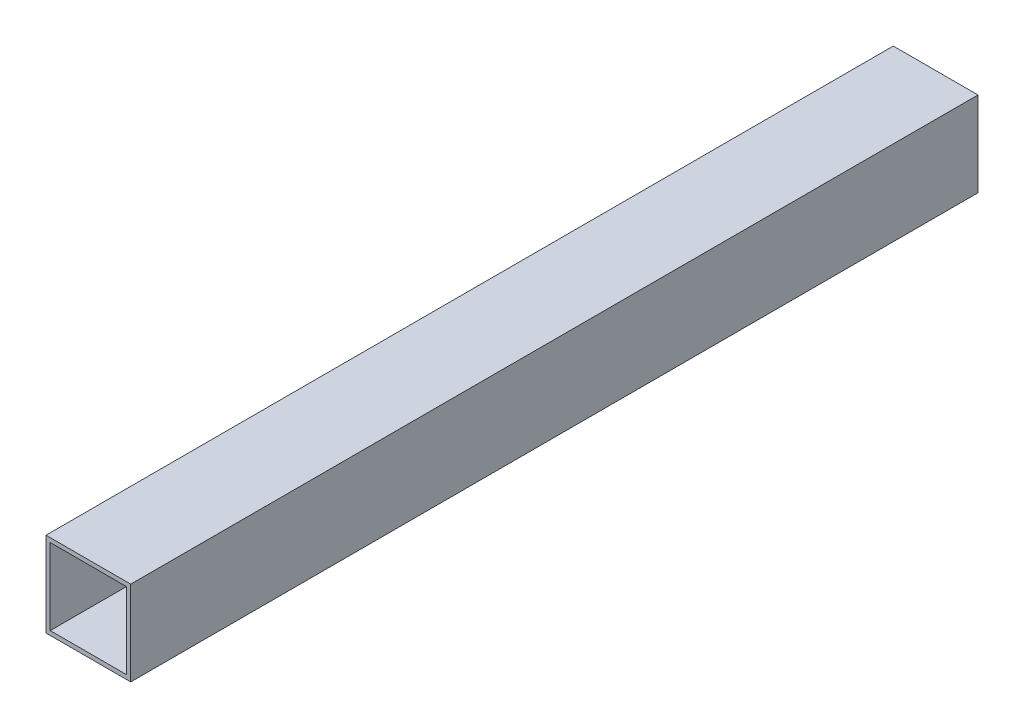
ISO-10303-21;
HEADER;
FILE_DESCRIPTION(('STEP AP214'),'2;1');
FILE_NAME('part.step','',(''),(''),'','','');
FILE_SCHEMA(('AUTOMOTIVE_DESIGN { 1 0 10303 214 1 1 1 1 }'));
ENDSEC;
DATA;
#1=APPLICATION_CONTEXT('core data for automotive mechanical design processes');
#2=APPLICATION_PROTOCOL_DEFINITION('international standard','automotive_design',2000,#1);
#3=PRODUCT_CONTEXT('',#1,'mechanical');
#4=PRODUCT('Part','Part','',(#3));
#5=PRODUCT_RELATED_PRODUCT_CATEGORY('part','',(#4));
#6=PRODUCT_DEFINITION_FORMATION('','',#4);
#7=PRODUCT_DEFINITION_CONTEXT('part definition',#1,'design');
#8=PRODUCT_DEFINITION('design','',#6,#7);
#9=PRODUCT_DEFINITION_SHAPE('','',#8);
#10=(LENGTH_UNIT() NAMED_UNIT(*) SI_UNIT(.MILLI.,.METRE.));
#11=(NAMED_UNIT(*) PLANE_ANGLE_UNIT() SI_UNIT($,.RADIAN.));
#12=(NAMED_UNIT(*) SI_UNIT($,.STERADIAN.) SOLID_ANGLE_UNIT());
#13=UNCERTAINTY_MEASURE_WITH_UNIT(LENGTH_MEASURE(1.E-05),#10,'distance_accuracy_value','');
#14=(GEOMETRIC_REPRESENTATION_CONTEXT(3) GLOBAL_UNCERTAINTY_ASSIGNED_CONTEXT((#13)) GLOBAL_UNIT_ASSIGNED_CONTEXT((#10,
#11,#12)) REPRESENTATION_CONTEXT('',''));
#15=CARTESIAN_POINT('',(0.,0.,0.));
#16=DIRECTION('',(0.,0.,1.));
#17=DIRECTION('',(1.,0.,0.));
#18=AXIS2_PLACEMENT_3D('',#15,#16,#17);
#19=CARTESIAN_POINT('',(0.,0.,500.));
#20=DIRECTION('',(0.,0.,-1.));
#21=DIRECTION('',(-1.,0.,0.));
#22=AXIS2_PLACEMENT_3D('',#19,#20,#21);
#23=PLANE('',#22);
#24=DIRECTION('',(0.,-1.,0.));
#25=VECTOR('',#24,1.);
#26=CARTESIAN_POINT('',(-50.,-50.,500.));
#27=LINE('',#26,#25);
#28=CARTESIAN_POINT('',(-50.,49.9999999999999,500.));
#29=VERTEX_POINT('',#28);
#30=CARTESIAN_POINT('',(-50.,-50.,500.));
#31=VERTEX_POINT('',#30);
#32=EDGE_CURVE('E162',#29,#31,#27,.T.);
#33=ORIENTED_EDGE('',*,*,#32,.T.);
#34=DIRECTION('',(1.,0.,0.));
#35=VECTOR('',#34,1.);
#36=CARTESIAN_POINT('',(-50.,-50.,500.));
#37=LINE('',#36,#35);
#38=CARTESIAN_POINT('',(50.,-50.,500.));
#39=VERTEX_POINT('',#38);
#40=EDGE_CURVE('E165',#31,#39,#37,.T.);
#41=ORIENTED_EDGE('',*,*,#40,.T.);
#42=DIRECTION('',(0.,1.,0.));
#43=VECTOR('',#42,1.);
#44=CARTESIAN_POINT('',(50.,-50.,500.));
#45=LINE('',#44,#43);
#46=CARTESIAN_POINT('',(49.9999999999999,49.9999999999999,500.));
#47=VERTEX_POINT('',#46);
#48=EDGE_CURVE('E168',#39,#47,#45,.T.);
#49=ORIENTED_EDGE('',*,*,#48,.T.);
#50=DIRECTION('',(-1.,0.,0.));
#51=VECTOR('',#50,1.);
#52=CARTESIAN_POINT('',(-50.,49.9999999999999,500.));
#53=LINE('',#52,#51);
#54=EDGE_CURVE('E170',#47,#29,#53,.T.);
#55=ORIENTED_EDGE('',*,*,#54,.T.);
#56=EDGE_LOOP('',(#33,#41,#49,#55));
#57=FACE_BOUND('',#56,.T.);
#58=DIRECTION('',(0.,-1.,0.));
#59=VECTOR('',#58,1.);
#60=CARTESIAN_POINT('',(-45.,-45.,500.));
#61=LINE('',#60,#59);
#62=CARTESIAN_POINT('',(-45.,44.9999999999999,500.));
#63=VERTEX_POINT('',#62);
#64=CARTESIAN_POINT('',(-45.,-45.,500.));
#65=VERTEX_POINT('',#64);
#66=EDGE_CURVE('E116',#63,#65,#61,.T.);
#67=ORIENTED_EDGE('',*,*,#66,.F.);
#68=DIRECTION('',(-1.,0.,0.));
#69=VECTOR('',#68,1.);
#70=CARTESIAN_POINT('',(-45.,44.9999999999999,500.));
#71=LINE('',#70,#69);
#72=CARTESIAN_POINT('',(45.,44.9999999999999,500.));
#73=VERTEX_POINT('',#72);
#74=EDGE_CURVE('E141',#73,#63,#71,.T.);
#75=ORIENTED_EDGE('',*,*,#74,.F.);
#76=DIRECTION('',(0.,1.,0.));
#77=VECTOR('',#76,1.);
#78=CARTESIAN_POINT('',(45.,-45.,500.));
#79=LINE('',#78,#77);
#80=CARTESIAN_POINT('',(45.,-45.,500.));
#81=VERTEX_POINT('',#80);
#82=EDGE_CURVE('E137',#81,#73,#79,.T.);
#83=ORIENTED_EDGE('',*,*,#82,.F.);
#84=DIRECTION('',(1.,0.,0.));
#85=VECTOR('',#84,1.);
#86=CARTESIAN_POINT('',(-45.,-45.,500.));
#87=LINE('',#86,#85);
#88=EDGE_CURVE('E124',#65,#81,#87,.T.);
#89=ORIENTED_EDGE('',*,*,#88,.F.);
#90=EDGE_LOOP('',(#67,#75,#83,#89));
#91=FACE_BOUND('',#90,.T.);
#92=ADVANCED_FACE('F40',(#57,#91),#23,.F.);
#93=CARTESIAN_POINT('',(0.,0.,-500.));
#94=DIRECTION('',(0.,0.,-1.));
#95=DIRECTION('',(-1.,0.,0.));
#96=AXIS2_PLACEMENT_3D('',#93,#94,#95);
#97=PLANE('',#96);
#98=DIRECTION('',(0.,-1.,0.));
#99=VECTOR('',#98,1.);
#100=CARTESIAN_POINT('',(-50.,-50.,-500.));
#101=LINE('',#100,#99);
#102=CARTESIAN_POINT('',(-50.,49.9999999999999,-500.));
#103=VERTEX_POINT('',#102);
#104=CARTESIAN_POINT('',(-50.,-50.,-500.));
#105=VERTEX_POINT('',#104);
#106=EDGE_CURVE('E133',#103,#105,#101,.T.);
#107=ORIENTED_EDGE('',*,*,#106,.F.);
#108=DIRECTION('',(-1.,0.,0.));
#109=VECTOR('',#108,1.);
#110=CARTESIAN_POINT('',(-50.,49.9999999999999,-500.));
#111=LINE('',#110,#109);
#112=CARTESIAN_POINT('',(49.9999999999999,49.9999999999999,-500.));
#113=VERTEX_POINT('',#112);
#114=EDGE_CURVE('E166',#113,#103,#111,.T.);
#115=ORIENTED_EDGE('',*,*,#114,.F.);
#116=DIRECTION('',(0.,1.,0.));
#117=VECTOR('',#116,1.);
#118=CARTESIAN_POINT('',(50.,-50.,-500.));
#119=LINE('',#118,#117);
#120=CARTESIAN_POINT('',(50.,-50.,-500.));
#121=VERTEX_POINT('',#120);
#122=EDGE_CURVE('E179',#121,#113,#119,.T.);
#123=ORIENTED_EDGE('',*,*,#122,.F.);
#124=DIRECTION('',(1.,0.,0.));
#125=VECTOR('',#124,1.);
#126=CARTESIAN_POINT('',(-50.,-50.,-500.));
#127=LINE('',#126,#125);
#128=EDGE_CURVE('E176',#105,#121,#127,.T.);
#129=ORIENTED_EDGE('',*,*,#128,.F.);
#130=EDGE_LOOP('',(#107,#115,#123,#129));
#131=FACE_BOUND('',#130,.T.);
#132=DIRECTION('',(-1.,0.,0.));
#133=VECTOR('',#132,1.);
#134=CARTESIAN_POINT('',(-45.,44.9999999999999,-500.));
#135=LINE('',#134,#133);
#136=CARTESIAN_POINT('',(45.,44.9999999999999,-500.));
#137=VERTEX_POINT('',#136);
#138=CARTESIAN_POINT('',(-45.,44.9999999999999,-500.));
#139=VERTEX_POINT('',#138);
#140=EDGE_CURVE('E125',#137,#139,#135,.T.);
#141=ORIENTED_EDGE('',*,*,#140,.T.);
#142=DIRECTION('',(0.,-1.,0.));
#143=VECTOR('',#142,1.);
#144=CARTESIAN_POINT('',(-45.,-45.,-500.));
#145=LINE('',#144,#143);
#146=CARTESIAN_POINT('',(-45.,-45.,-500.));
#147=VERTEX_POINT('',#146);
#148=EDGE_CURVE('E67',#139,#147,#145,.T.);
#149=ORIENTED_EDGE('',*,*,#148,.T.);
#150=DIRECTION('',(1.,0.,0.));
#151=VECTOR('',#150,1.);
#152=CARTESIAN_POINT('',(-45.,-45.,-500.));
#153=LINE('',#152,#151);
#154=CARTESIAN_POINT('',(45.,-45.,-500.));
#155=VERTEX_POINT('',#154);
#156=EDGE_CURVE('E131',#147,#155,#153,.T.);
#157=ORIENTED_EDGE('',*,*,#156,.T.);
#158=DIRECTION('',(0.,1.,0.));
#159=VECTOR('',#158,1.);
#160=CARTESIAN_POINT('',(45.,-45.,-500.));
#161=LINE('',#160,#159);
#162=EDGE_CURVE('E149',#155,#137,#161,.T.);
#163=ORIENTED_EDGE('',*,*,#162,.T.);
#164=EDGE_LOOP('',(#141,#149,#157,#163));
#165=FACE_BOUND('',#164,.T.);
#166=ADVANCED_FACE('F202',(#131,#165),#97,.T.);
#167=CARTESIAN_POINT('',(-50.,-50.,500.));
#168=DIRECTION('',(1.,0.,0.));
#169=DIRECTION('',(0.,0.,-1.));
#170=AXIS2_PLACEMENT_3D('',#167,#168,#169);
#171=PLANE('',#170);
#172=ORIENTED_EDGE('',*,*,#106,.T.);
#173=DIRECTION('',(0.,0.,-1.));
#174=VECTOR('',#173,1.);
#175=CARTESIAN_POINT('',(-50.,-50.,500.));
#176=LINE('',#175,#174);
#177=EDGE_CURVE('E11',#31,#105,#176,.T.);
#178=ORIENTED_EDGE('',*,*,#177,.F.);
#179=ORIENTED_EDGE('',*,*,#32,.F.);
#180=DIRECTION('',(0.,0.,-1.));
#181=VECTOR('',#180,1.);
#182=CARTESIAN_POINT('',(-50.,49.9999999999999,500.));
#183=LINE('',#182,#181);
#184=EDGE_CURVE('E172',#29,#103,#183,.T.);
#185=ORIENTED_EDGE('',*,*,#184,.T.);
#186=EDGE_LOOP('',(#172,#178,#179,#185));
#187=FACE_BOUND('',#186,.T.);
#188=ADVANCED_FACE('F42',(#187),#171,.F.);
#189=CARTESIAN_POINT('',(-50.,-50.,500.));
#190=DIRECTION('',(0.,1.,0.));
#191=DIRECTION('',(0.,0.,1.));
#192=AXIS2_PLACEMENT_3D('',#189,#190,#191);
#193=PLANE('',#192);
#194=ORIENTED_EDGE('',*,*,#128,.T.);
#195=DIRECTION('',(0.,0.,-1.));
#196=VECTOR('',#195,1.);
#197=CARTESIAN_POINT('',(50.,-50.,500.));
#198=LINE('',#197,#196);
#199=EDGE_CURVE('E49',#39,#121,#198,.T.);
#200=ORIENTED_EDGE('',*,*,#199,.F.);
#201=ORIENTED_EDGE('',*,*,#40,.F.);
#202=ORIENTED_EDGE('',*,*,#177,.T.);
#203=EDGE_LOOP('',(#194,#200,#201,#202));
#204=FACE_BOUND('',#203,.T.);
#205=ADVANCED_FACE('F212',(#204),#193,.F.);
#206=CARTESIAN_POINT('',(50.,-50.,500.));
#207=DIRECTION('',(-1.,0.,0.));
#208=DIRECTION('',(0.,-1.,0.));
#209=AXIS2_PLACEMENT_3D('',#206,#207,#208);
#210=PLANE('',#209);
#211=ORIENTED_EDGE('',*,*,#122,.T.);
#212=DIRECTION('',(0.,0.,-1.));
#213=VECTOR('',#212,1.);
#214=CARTESIAN_POINT('',(49.9999999999999,49.9999999999999,500.));
#215=LINE('',#214,#213);
#216=EDGE_CURVE('E187',#47,#113,#215,.T.);
#217=ORIENTED_EDGE('',*,*,#216,.F.);
#218=ORIENTED_EDGE('',*,*,#48,.F.);
#219=ORIENTED_EDGE('',*,*,#199,.T.);
#220=EDGE_LOOP('',(#211,#217,#218,#219));
#221=FACE_BOUND('',#220,.T.);
#222=ADVANCED_FACE('F196',(#221),#210,.F.);
#223=CARTESIAN_POINT('',(-50.,49.9999999999999,500.));
#224=DIRECTION('',(0.,-1.,0.));
#225=DIRECTION('',(0.,0.,-1.));
#226=AXIS2_PLACEMENT_3D('',#223,#224,#225);
#227=PLANE('',#226);
#228=ORIENTED_EDGE('',*,*,#114,.T.);
#229=ORIENTED_EDGE('',*,*,#184,.F.);
#230=ORIENTED_EDGE('',*,*,#54,.F.);
#231=ORIENTED_EDGE('',*,*,#216,.T.);
#232=EDGE_LOOP('',(#228,#229,#230,#231));
#233=FACE_BOUND('',#232,.T.);
#234=ADVANCED_FACE('F206',(#233),#227,.F.);
#235=CARTESIAN_POINT('',(-45.,-45.,500.));
#236=DIRECTION('',(1.,0.,0.));
#237=DIRECTION('',(0.,0.,-1.));
#238=AXIS2_PLACEMENT_3D('',#235,#236,#237);
#239=PLANE('',#238);
#240=ORIENTED_EDGE('',*,*,#148,.F.);
#241=DIRECTION('',(0.,0.,-1.));
#242=VECTOR('',#241,1.);
#243=CARTESIAN_POINT('',(-45.,44.9999999999999,500.));
#244=LINE('',#243,#242);
#245=EDGE_CURVE('E120',#63,#139,#244,.T.);
#246=ORIENTED_EDGE('',*,*,#245,.F.);
#247=ORIENTED_EDGE('',*,*,#66,.T.);
#248=DIRECTION('',(0.,0.,-1.));
#249=VECTOR('',#248,1.);
#250=CARTESIAN_POINT('',(-45.,-45.,500.));
#251=LINE('',#250,#249);
#252=EDGE_CURVE('E119',#65,#147,#251,.T.);
#253=ORIENTED_EDGE('',*,*,#252,.T.);
#254=EDGE_LOOP('',(#240,#246,#247,#253));
#255=FACE_BOUND('',#254,.T.);
#256=ADVANCED_FACE('F118',(#255),#239,.T.);
#257=CARTESIAN_POINT('',(-45.,-45.,500.));
#258=DIRECTION('',(0.,1.,0.));
#259=DIRECTION('',(0.,0.,1.));
#260=AXIS2_PLACEMENT_3D('',#257,#258,#259);
#261=PLANE('',#260);
#262=ORIENTED_EDGE('',*,*,#156,.F.);
#263=ORIENTED_EDGE('',*,*,#252,.F.);
#264=ORIENTED_EDGE('',*,*,#88,.T.);
#265=DIRECTION('',(0.,0.,-1.));
#266=VECTOR('',#265,1.);
#267=CARTESIAN_POINT('',(45.,-45.,500.));
#268=LINE('',#267,#266);
#269=EDGE_CURVE('E134',#81,#155,#268,.T.);
#270=ORIENTED_EDGE('',*,*,#269,.T.);
#271=EDGE_LOOP('',(#262,#263,#264,#270));
#272=FACE_BOUND('',#271,.T.);
#273=ADVANCED_FACE('F128',(#272),#261,.T.);
#274=CARTESIAN_POINT('',(45.,-45.,500.));
#275=DIRECTION('',(-1.,0.,0.));
#276=DIRECTION('',(0.,-1.,0.));
#277=AXIS2_PLACEMENT_3D('',#274,#275,#276);
#278=PLANE('',#277);
#279=ORIENTED_EDGE('',*,*,#162,.F.);
#280=ORIENTED_EDGE('',*,*,#269,.F.);
#281=ORIENTED_EDGE('',*,*,#82,.T.);
#282=DIRECTION('',(0.,0.,-1.));
#283=VECTOR('',#282,1.);
#284=CARTESIAN_POINT('',(45.,44.9999999999999,500.));
#285=LINE('',#284,#283);
#286=EDGE_CURVE('E56',#73,#137,#285,.T.);
#287=ORIENTED_EDGE('',*,*,#286,.T.);
#288=EDGE_LOOP('',(#279,#280,#281,#287));
#289=FACE_BOUND('',#288,.T.);
#290=ADVANCED_FACE('F235',(#289),#278,.T.);
#291=CARTESIAN_POINT('',(-45.,44.9999999999999,500.));
#292=DIRECTION('',(0.,-1.,0.));
#293=DIRECTION('',(0.,0.,-1.));
#294=AXIS2_PLACEMENT_3D('',#291,#292,#293);
#295=PLANE('',#294);
#296=ORIENTED_EDGE('',*,*,#140,.F.);
#297=ORIENTED_EDGE('',*,*,#286,.F.);
#298=ORIENTED_EDGE('',*,*,#74,.T.);
#299=ORIENTED_EDGE('',*,*,#245,.T.);
#300=EDGE_LOOP('',(#296,#297,#298,#299));
#301=FACE_BOUND('',#300,.T.);
#302=ADVANCED_FACE('F239',(#301),#295,.T.);
#303=CLOSED_SHELL('',(#92,#166,#188,#205,#222,#234,#256,#273,#290,#302));
#304=MANIFOLD_SOLID_BREP('B2',#303);
#305=ADVANCED_BREP_SHAPE_REPRESENTATION('',(#18,#304),#14);
#306=SHAPE_DEFINITION_REPRESENTATION(#9,#305);
ENDSEC;
END-ISO-10303-21;
